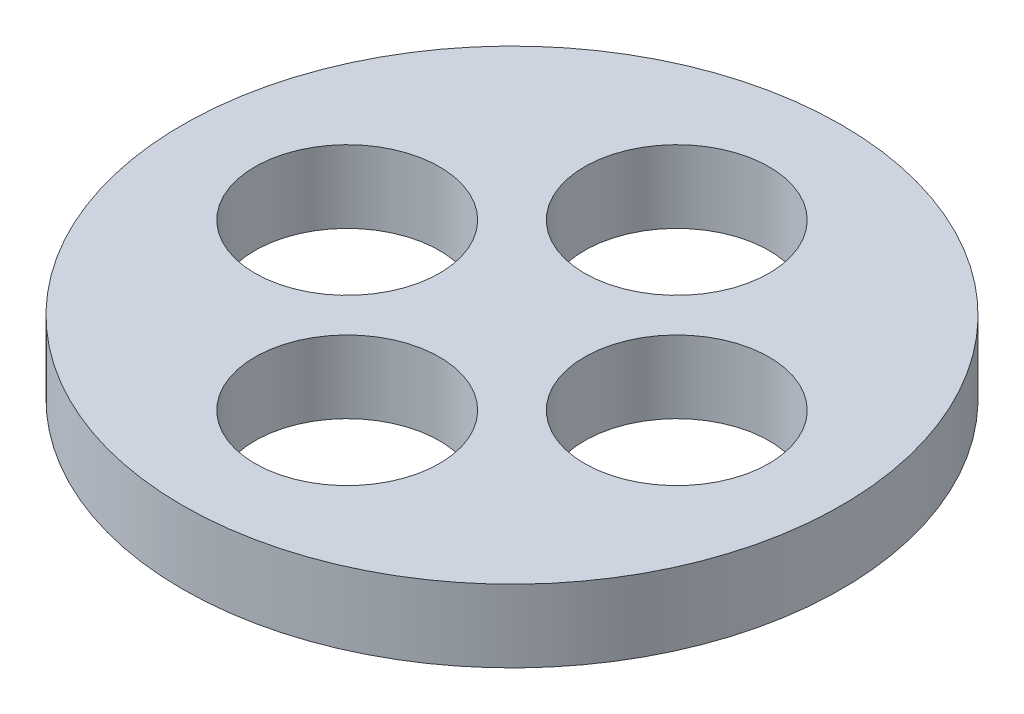
ISO-10303-21;
HEADER;
FILE_DESCRIPTION(('STEP AP214'),'2;1');
FILE_NAME('part.step','',(''),(''),'','','');
FILE_SCHEMA(('AUTOMOTIVE_DESIGN { 1 0 10303 214 1 1 1 1 }'));
ENDSEC;
DATA;
#1=APPLICATION_CONTEXT('core data for automotive mechanical design processes');
#2=APPLICATION_PROTOCOL_DEFINITION('international standard','automotive_design',2000,#1);
#3=PRODUCT_CONTEXT('',#1,'mechanical');
#4=PRODUCT('Part','Part','',(#3));
#5=PRODUCT_RELATED_PRODUCT_CATEGORY('part','',(#4));
#6=PRODUCT_DEFINITION_FORMATION('','',#4);
#7=PRODUCT_DEFINITION_CONTEXT('part definition',#1,'design');
#8=PRODUCT_DEFINITION('design','',#6,#7);
#9=PRODUCT_DEFINITION_SHAPE('','',#8);
#10=(LENGTH_UNIT() NAMED_UNIT(*) SI_UNIT(.MILLI.,.METRE.));
#11=(NAMED_UNIT(*) PLANE_ANGLE_UNIT() SI_UNIT($,.RADIAN.));
#12=(NAMED_UNIT(*) SI_UNIT($,.STERADIAN.) SOLID_ANGLE_UNIT());
#13=UNCERTAINTY_MEASURE_WITH_UNIT(LENGTH_MEASURE(1.E-05),#10,'distance_accuracy_value','');
#14=(GEOMETRIC_REPRESENTATION_CONTEXT(3) GLOBAL_UNCERTAINTY_ASSIGNED_CONTEXT((#13)) GLOBAL_UNIT_ASSIGNED_CONTEXT((#10,
#11,#12)) REPRESENTATION_CONTEXT('',''));
#15=CARTESIAN_POINT('',(0.,0.,0.));
#16=DIRECTION('',(0.,0.,1.));
#17=DIRECTION('',(1.,0.,0.));
#18=AXIS2_PLACEMENT_3D('',#15,#16,#17);
#19=CARTESIAN_POINT('',(0.,5.5,0.));
#20=DIRECTION('',(0.,-1.,0.));
#21=DIRECTION('',(0.,0.,-1.));
#22=AXIS2_PLACEMENT_3D('',#19,#20,#21);
#23=CYLINDRICAL_SURFACE('',#22,25.);
#24=CARTESIAN_POINT('',(0.,5.5,0.));
#25=DIRECTION('',(0.,1.,0.));
#26=DIRECTION('',(0.,0.,1.));
#27=AXIS2_PLACEMENT_3D('',#24,#25,#26);
#28=CIRCLE('',#27,25.);
#29=CARTESIAN_POINT('',(0.,5.5,25.));
#30=VERTEX_POINT('',#29);
#31=EDGE_CURVE('E10',#30,#30,#28,.T.);
#32=ORIENTED_EDGE('',*,*,#31,.F.);
#33=EDGE_LOOP('',(#32));
#34=FACE_BOUND('',#33,.T.);
#35=CARTESIAN_POINT('',(0.,0.,0.));
#36=DIRECTION('',(0.,1.,0.));
#37=DIRECTION('',(0.,0.,1.));
#38=AXIS2_PLACEMENT_3D('',#35,#36,#37);
#39=CIRCLE('',#38,25.);
#40=CARTESIAN_POINT('',(0.,0.,25.));
#41=VERTEX_POINT('',#40);
#42=EDGE_CURVE('E40',#41,#41,#39,.T.);
#43=ORIENTED_EDGE('',*,*,#42,.T.);
#44=EDGE_LOOP('',(#43));
#45=FACE_BOUND('',#44,.T.);
#46=ADVANCED_FACE('F37',(#34,#45),#23,.T.);
#47=CARTESIAN_POINT('',(0.,5.5,0.));
#48=DIRECTION('',(0.,1.,0.));
#49=DIRECTION('',(0.,0.,1.));
#50=AXIS2_PLACEMENT_3D('',#47,#48,#49);
#51=PLANE('',#50);
#52=CARTESIAN_POINT('',(0.,5.5,12.5));
#53=DIRECTION('',(0.,1.,0.));
#54=DIRECTION('',(0.,0.,1.));
#55=AXIS2_PLACEMENT_3D('',#52,#53,#54);
#56=CIRCLE('',#55,7.);
#57=CARTESIAN_POINT('',(0.,5.5,19.5));
#58=VERTEX_POINT('',#57);
#59=EDGE_CURVE('E67',#58,#58,#56,.T.);
#60=ORIENTED_EDGE('',*,*,#59,.F.);
#61=EDGE_LOOP('',(#60));
#62=FACE_BOUND('',#61,.T.);
#63=CARTESIAN_POINT('',(12.5,5.5,0.));
#64=DIRECTION('',(0.,1.,0.));
#65=DIRECTION('',(0.,0.,1.));
#66=AXIS2_PLACEMENT_3D('',#63,#64,#65);
#67=CIRCLE('',#66,7.);
#68=CARTESIAN_POINT('',(12.5,5.5,7.));
#69=VERTEX_POINT('',#68);
#70=EDGE_CURVE('E59',#69,#69,#67,.T.);
#71=ORIENTED_EDGE('',*,*,#70,.F.);
#72=EDGE_LOOP('',(#71));
#73=FACE_BOUND('',#72,.T.);
#74=CARTESIAN_POINT('',(-12.5,5.5,0.));
#75=DIRECTION('',(0.,1.,0.));
#76=DIRECTION('',(0.,0.,1.));
#77=AXIS2_PLACEMENT_3D('',#74,#75,#76);
#78=CIRCLE('',#77,7.);
#79=CARTESIAN_POINT('',(-12.5,5.5,7.));
#80=VERTEX_POINT('',#79);
#81=EDGE_CURVE('E75',#80,#80,#78,.T.);
#82=ORIENTED_EDGE('',*,*,#81,.F.);
#83=EDGE_LOOP('',(#82));
#84=FACE_BOUND('',#83,.T.);
#85=CARTESIAN_POINT('',(0.,5.5,-12.5));
#86=DIRECTION('',(0.,1.,0.));
#87=DIRECTION('',(0.,0.,1.));
#88=AXIS2_PLACEMENT_3D('',#85,#86,#87);
#89=CIRCLE('',#88,7.);
#90=CARTESIAN_POINT('',(0.,5.5,-5.5));
#91=VERTEX_POINT('',#90);
#92=EDGE_CURVE('E51',#91,#91,#89,.T.);
#93=ORIENTED_EDGE('',*,*,#92,.F.);
#94=EDGE_LOOP('',(#93));
#95=FACE_BOUND('',#94,.T.);
#96=ORIENTED_EDGE('',*,*,#31,.T.);
#97=EDGE_LOOP('',(#96));
#98=FACE_BOUND('',#97,.T.);
#99=ADVANCED_FACE('F94',(#62,#73,#84,#95,#98),#51,.T.);
#100=CARTESIAN_POINT('',(0.,0.,0.));
#101=DIRECTION('',(0.,1.,0.));
#102=DIRECTION('',(0.,0.,1.));
#103=AXIS2_PLACEMENT_3D('',#100,#101,#102);
#104=PLANE('',#103);
#105=CARTESIAN_POINT('',(0.,0.,12.5));
#106=DIRECTION('',(0.,1.,0.));
#107=DIRECTION('',(0.,0.,1.));
#108=AXIS2_PLACEMENT_3D('',#105,#106,#107);
#109=CIRCLE('',#108,7.);
#110=CARTESIAN_POINT('',(0.,0.,19.5));
#111=VERTEX_POINT('',#110);
#112=EDGE_CURVE('E63',#111,#111,#109,.T.);
#113=ORIENTED_EDGE('',*,*,#112,.T.);
#114=EDGE_LOOP('',(#113));
#115=FACE_BOUND('',#114,.T.);
#116=CARTESIAN_POINT('',(12.5,0.,0.));
#117=DIRECTION('',(0.,1.,0.));
#118=DIRECTION('',(0.,0.,1.));
#119=AXIS2_PLACEMENT_3D('',#116,#117,#118);
#120=CIRCLE('',#119,7.);
#121=CARTESIAN_POINT('',(12.5,0.,7.));
#122=VERTEX_POINT('',#121);
#123=EDGE_CURVE('E55',#122,#122,#120,.T.);
#124=ORIENTED_EDGE('',*,*,#123,.T.);
#125=EDGE_LOOP('',(#124));
#126=FACE_BOUND('',#125,.T.);
#127=CARTESIAN_POINT('',(-12.5,0.,0.));
#128=DIRECTION('',(0.,1.,0.));
#129=DIRECTION('',(0.,0.,1.));
#130=AXIS2_PLACEMENT_3D('',#127,#128,#129);
#131=CIRCLE('',#130,7.);
#132=CARTESIAN_POINT('',(-12.5,0.,7.));
#133=VERTEX_POINT('',#132);
#134=EDGE_CURVE('E71',#133,#133,#131,.T.);
#135=ORIENTED_EDGE('',*,*,#134,.T.);
#136=EDGE_LOOP('',(#135));
#137=FACE_BOUND('',#136,.T.);
#138=CARTESIAN_POINT('',(0.,0.,-12.5));
#139=DIRECTION('',(0.,1.,0.));
#140=DIRECTION('',(0.,0.,1.));
#141=AXIS2_PLACEMENT_3D('',#138,#139,#140);
#142=CIRCLE('',#141,7.);
#143=CARTESIAN_POINT('',(0.,0.,-5.5));
#144=VERTEX_POINT('',#143);
#145=EDGE_CURVE('E49',#144,#144,#142,.T.);
#146=ORIENTED_EDGE('',*,*,#145,.T.);
#147=EDGE_LOOP('',(#146));
#148=FACE_BOUND('',#147,.T.);
#149=ORIENTED_EDGE('',*,*,#42,.F.);
#150=EDGE_LOOP('',(#149));
#151=FACE_BOUND('',#150,.T.);
#152=ADVANCED_FACE('F83',(#115,#126,#137,#148,#151),#104,.F.);
#153=CARTESIAN_POINT('',(0.,0.,-12.5));
#154=DIRECTION('',(0.,1.,0.));
#155=DIRECTION('',(0.,0.,1.));
#156=AXIS2_PLACEMENT_3D('',#153,#154,#155);
#157=CYLINDRICAL_SURFACE('',#156,7.);
#158=ORIENTED_EDGE('',*,*,#145,.F.);
#159=EDGE_LOOP('',(#158));
#160=FACE_BOUND('',#159,.T.);
#161=ORIENTED_EDGE('',*,*,#92,.T.);
#162=EDGE_LOOP('',(#161));
#163=FACE_BOUND('',#162,.T.);
#164=ADVANCED_FACE('F90',(#160,#163),#157,.F.);
#165=CARTESIAN_POINT('',(-12.5,0.,0.));
#166=DIRECTION('',(0.,1.,0.));
#167=DIRECTION('',(0.,0.,1.));
#168=AXIS2_PLACEMENT_3D('',#165,#166,#167);
#169=CYLINDRICAL_SURFACE('',#168,7.);
#170=ORIENTED_EDGE('',*,*,#134,.F.);
#171=EDGE_LOOP('',(#170));
#172=FACE_BOUND('',#171,.T.);
#173=ORIENTED_EDGE('',*,*,#81,.T.);
#174=EDGE_LOOP('',(#173));
#175=FACE_BOUND('',#174,.T.);
#176=ADVANCED_FACE('F86',(#172,#175),#169,.F.);
#177=CARTESIAN_POINT('',(12.5,0.,0.));
#178=DIRECTION('',(0.,1.,0.));
#179=DIRECTION('',(0.,0.,1.));
#180=AXIS2_PLACEMENT_3D('',#177,#178,#179);
#181=CYLINDRICAL_SURFACE('',#180,7.);
#182=ORIENTED_EDGE('',*,*,#123,.F.);
#183=EDGE_LOOP('',(#182));
#184=FACE_BOUND('',#183,.T.);
#185=ORIENTED_EDGE('',*,*,#70,.T.);
#186=EDGE_LOOP('',(#185));
#187=FACE_BOUND('',#186,.T.);
#188=ADVANCED_FACE('F89',(#184,#187),#181,.F.);
#189=CARTESIAN_POINT('',(0.,0.,12.5));
#190=DIRECTION('',(0.,1.,0.));
#191=DIRECTION('',(0.,0.,1.));
#192=AXIS2_PLACEMENT_3D('',#189,#190,#191);
#193=CYLINDRICAL_SURFACE('',#192,7.);
#194=ORIENTED_EDGE('',*,*,#112,.F.);
#195=EDGE_LOOP('',(#194));
#196=FACE_BOUND('',#195,.T.);
#197=ORIENTED_EDGE('',*,*,#59,.T.);
#198=EDGE_LOOP('',(#197));
#199=FACE_BOUND('',#198,.T.);
#200=ADVANCED_FACE('F144',(#196,#199),#193,.F.);
#201=CLOSED_SHELL('',(#46,#99,#152,#164,#176,#188,#200));
#202=MANIFOLD_SOLID_BREP('B2',#201);
#203=ADVANCED_BREP_SHAPE_REPRESENTATION('',(#18,#202),#14);
#204=SHAPE_DEFINITION_REPRESENTATION(#9,#203);
ENDSEC;
END-ISO-10303-21;
